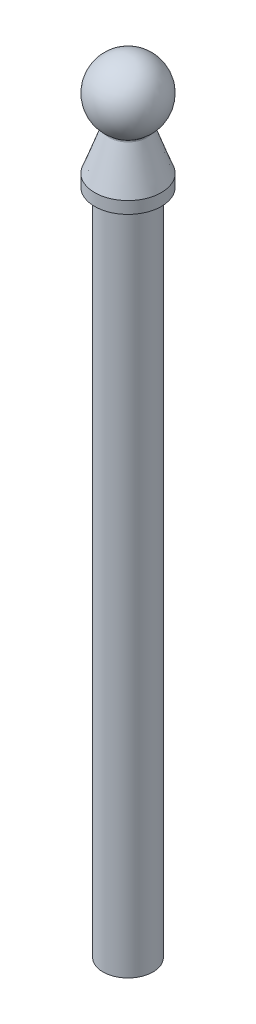
ISO-10303-21;
HEADER;
FILE_DESCRIPTION(('STEP AP214'),'2;1');
FILE_NAME('part.step','',(''),(''),'','','');
FILE_SCHEMA(('AUTOMOTIVE_DESIGN { 1 0 10303 214 1 1 1 1 }'));
ENDSEC;
DATA;
#1=APPLICATION_CONTEXT('core data for automotive mechanical design processes');
#2=APPLICATION_PROTOCOL_DEFINITION('international standard','automotive_design',2000,#1);
#3=PRODUCT_CONTEXT('',#1,'mechanical');
#4=PRODUCT('Part','Part','',(#3));
#5=PRODUCT_RELATED_PRODUCT_CATEGORY('part','',(#4));
#6=PRODUCT_DEFINITION_FORMATION('','',#4);
#7=PRODUCT_DEFINITION_CONTEXT('part definition',#1,'design');
#8=PRODUCT_DEFINITION('design','',#6,#7);
#9=PRODUCT_DEFINITION_SHAPE('','',#8);
#10=(LENGTH_UNIT() NAMED_UNIT(*) SI_UNIT(.MILLI.,.METRE.));
#11=(NAMED_UNIT(*) PLANE_ANGLE_UNIT() SI_UNIT($,.RADIAN.));
#12=(NAMED_UNIT(*) SI_UNIT($,.STERADIAN.) SOLID_ANGLE_UNIT());
#13=UNCERTAINTY_MEASURE_WITH_UNIT(LENGTH_MEASURE(1.E-05),#10,'distance_accuracy_value','');
#14=(GEOMETRIC_REPRESENTATION_CONTEXT(3) GLOBAL_UNCERTAINTY_ASSIGNED_CONTEXT((#13)) GLOBAL_UNIT_ASSIGNED_CONTEXT((#10,
#11,#12)) REPRESENTATION_CONTEXT('',''));
#15=CARTESIAN_POINT('',(0.,0.,0.));
#16=DIRECTION('',(0.,0.,1.));
#17=DIRECTION('',(1.,0.,0.));
#18=AXIS2_PLACEMENT_3D('',#15,#16,#17);
#19=CARTESIAN_POINT('',(-9.63673585374636E-11,97.7333199999983,1.90958360235527E-11));
#20=DIRECTION('',(0.,1.,0.));
#21=DIRECTION('',(0.616561156413366,0.,-0.787307017879437));
#22=AXIS2_PLACEMENT_3D('',#19,#20,#21);
#23=SPHERICAL_SURFACE('',#22,40.);
#24=CARTESIAN_POINT('',(-9.63676972246134E-11,65.1933451381229,1.90960053671276E-11));
#25=DIRECTION('',(0.,1.,0.));
#26=DIRECTION('',(-0.616561156413366,0.,0.787307017879437));
#27=AXIS2_PLACEMENT_3D('',#24,#25,#26);
#28=CIRCLE('',#27,23.2626317511265);
#29=CARTESIAN_POINT('',(-14.3428351337892,65.1933451381229,18.314833232026));
#30=VERTEX_POINT('',#29);
#31=EDGE_CURVE('E56',#30,#30,#28,.T.);
#32=ORIENTED_EDGE('',*,*,#31,.T.);
#33=EDGE_LOOP('',(#32));
#34=FACE_BOUND('',#33,.T.);
#35=ADVANCED_FACE('F37',(#34),#23,.T.);
#36=CARTESIAN_POINT('',(-9.63677060984E-11,64.3407801882264,1.90960098040209E-11));
#37=DIRECTION('',(0.,-1.,0.));
#38=DIRECTION('',(0.616561156413366,0.,-0.787307017879437));
#39=AXIS2_PLACEMENT_3D('',#36,#37,#38);
#40=CONICAL_SURFACE('',#39,22.0213143322379,0.345555580581712);
#41=CARTESIAN_POINT('',(-9.63677212099862E-11,62.8889074584837,1.9096017359814E-11));
#42=DIRECTION('',(0.,-1.,0.));
#43=DIRECTION('',(0.616561156413366,0.,-0.787307017879437));
#44=AXIS2_PLACEMENT_3D('',#41,#42,#43);
#45=CIRCLE('',#44,22.5439885149453);
#46=CARTESIAN_POINT('',(13.899747628848,62.8889074584837,-17.7490403687908));
#47=VERTEX_POINT('',#46);
#48=EDGE_CURVE('E51',#47,#47,#45,.T.);
#49=CARTESIAN_POINT('',(-9.63682258991496E-11,14.3999916607443,1.90962697043957E-11));
#50=DIRECTION('',(0.,1.,0.));
#51=DIRECTION('',(-0.616561156413366,0.,0.787307017879437));
#52=AXIS2_PLACEMENT_3D('',#49,#50,#51);
#53=CIRCLE('',#52,39.9999982021314);
#54=CARTESIAN_POINT('',(24.6624451479424,14.3999916607443,-31.4922792996839));
#55=VERTEX_POINT('',#54);
#56=EDGE_CURVE('E60',#55,#55,#53,.T.);
#57=CARTESIAN_POINT('',(13.899747628848,62.8889074584837,-17.7490403687908));
#58=CARTESIAN_POINT('',(14.0118590613385,62.3838145855906,-17.8921991076542));
#59=CARTESIAN_POINT('',(14.1239704938291,61.8787217126974,-18.0353578465177));
#60=CARTESIAN_POINT('',(14.3481933588102,60.8685359669112,-18.3216753242447));
#61=CARTESIAN_POINT('',(14.4603047913008,60.3634430940181,-18.4648340631081));
#62=CARTESIAN_POINT('',(14.6845276562819,59.3532573482318,-18.7511515408351));
#63=CARTESIAN_POINT('',(14.7966390887725,58.8481644753387,-18.8943102796985));
#64=CARTESIAN_POINT('',(15.0208619537536,57.8379787295525,-19.1806277574255));
#65=CARTESIAN_POINT('',(15.1329733862442,57.3328858566594,-19.3237864962889));
#66=CARTESIAN_POINT('',(15.3571962512253,56.3227001108731,-19.6101039740159));
#67=CARTESIAN_POINT('',(15.4693076837159,55.81760723798,-19.7532627128793));
#68=CARTESIAN_POINT('',(15.693530548697,54.8074214921938,-20.0395801906063));
#69=CARTESIAN_POINT('',(15.8056419811876,54.3023286193007,-20.1827389294698));
#70=CARTESIAN_POINT('',(16.0298648461687,53.2921428735144,-20.4690564071967));
#71=CARTESIAN_POINT('',(16.1419762786593,52.7870500006213,-20.6122151460602));
#72=CARTESIAN_POINT('',(16.3661991436404,51.7768642548351,-20.8985326237871));
#73=CARTESIAN_POINT('',(16.478310576131,51.271771381942,-21.0416913626506));
#74=CARTESIAN_POINT('',(16.7025334411121,50.2615856361557,-21.3280088403775));
#75=CARTESIAN_POINT('',(16.8146448736027,49.7564927632626,-21.471167579241));
#76=CARTESIAN_POINT('',(17.0388677385838,48.7463070174764,-21.7574850569679));
#77=CARTESIAN_POINT('',(17.1509791710744,48.2412141445833,-21.9006437958314));
#78=CARTESIAN_POINT('',(17.3752020360555,47.231028398797,-22.1869612735583));
#79=CARTESIAN_POINT('',(17.4873134685461,46.7259355259039,-22.3301200124218));
#80=CARTESIAN_POINT('',(17.7115363335272,45.7157497801177,-22.6164374901487));
#81=CARTESIAN_POINT('',(17.8236477660178,45.2106569072245,-22.7595962290122));
#82=CARTESIAN_POINT('',(18.0478706309989,44.2004711614383,-23.0459137067391));
#83=CARTESIAN_POINT('',(18.1599820634895,43.6953782885452,-23.1890724456026));
#84=CARTESIAN_POINT('',(18.3842049284706,42.685192542759,-23.4753899233296));
#85=CARTESIAN_POINT('',(18.4963163609612,42.1800996698658,-23.618548662193));
#86=CARTESIAN_POINT('',(18.7205392259423,41.1699139240796,-23.90486613992));
#87=CARTESIAN_POINT('',(18.8326506584329,40.6648210511865,-24.0480248787834));
#88=CARTESIAN_POINT('',(19.056873523414,39.6546353054003,-24.3343423565104));
#89=CARTESIAN_POINT('',(19.1689849559046,39.1495424325071,-24.4775010953738));
#90=CARTESIAN_POINT('',(19.3932078208857,38.1393566867209,-24.7638185731008));
#91=CARTESIAN_POINT('',(19.5053192533763,37.6342638138278,-24.9069773119643));
#92=CARTESIAN_POINT('',(19.7295421183574,36.6240780680415,-25.1932947896912));
#93=CARTESIAN_POINT('',(19.841653550848,36.1189851951484,-25.3364535285547));
#94=CARTESIAN_POINT('',(20.0658764158291,35.1087994493622,-25.6227710062816));
#95=CARTESIAN_POINT('',(20.1779878483197,34.6037065764691,-25.7659297451451));
#96=CARTESIAN_POINT('',(20.4022107133008,33.5935208306828,-26.052247222872));
#97=CARTESIAN_POINT('',(20.5143221457914,33.0884279577897,-26.1954059617355));
#98=CARTESIAN_POINT('',(20.7385450107725,32.0782422120035,-26.4817234394624));
#99=CARTESIAN_POINT('',(20.8506564432631,31.5731493391104,-26.6248821783259));
#100=CARTESIAN_POINT('',(21.0748793082442,30.5629635933241,-26.9111996560528));
#101=CARTESIAN_POINT('',(21.1869907407348,30.057870720431,-27.0543583949163));
#102=CARTESIAN_POINT('',(21.4112136057159,29.0476849746448,-27.3406758726432));
#103=CARTESIAN_POINT('',(21.5233250382065,28.5425921017517,-27.4838346115067));
#104=CARTESIAN_POINT('',(21.7475479031876,27.5324063559654,-27.7701520892336));
#105=CARTESIAN_POINT('',(21.8596593356782,27.0273134830723,-27.9133108280971));
#106=CARTESIAN_POINT('',(22.0838822006593,26.0171277372861,-28.199628305824));
#107=CARTESIAN_POINT('',(22.1959936331499,25.5120348643929,-28.3427870446875));
#108=CARTESIAN_POINT('',(22.420216498131,24.5018491186067,-28.6291045224145));
#109=CARTESIAN_POINT('',(22.5323279306216,23.9967562457136,-28.7722632612779));
#110=CARTESIAN_POINT('',(22.7565507956027,22.9865704999273,-29.0585807390049));
#111=CARTESIAN_POINT('',(22.8686622280933,22.4814776270342,-29.2017394778683));
#112=CARTESIAN_POINT('',(23.0928850930744,21.471291881248,-29.4880569555953));
#113=CARTESIAN_POINT('',(23.204996525565,20.9661990083549,-29.6312156944587));
#114=CARTESIAN_POINT('',(23.4292193905461,19.9560132625686,-29.9175331721857));
#115=CARTESIAN_POINT('',(23.5413308230367,19.4509203896755,-30.0606919110492));
#116=CARTESIAN_POINT('',(23.7655536880178,18.4407346438893,-30.3470093887761));
#117=CARTESIAN_POINT('',(23.8776651205084,17.9356417709962,-30.4901681276396));
#118=CARTESIAN_POINT('',(24.1018879854895,16.9254560252099,-30.7764856053665));
#119=CARTESIAN_POINT('',(24.2139994179801,16.4203631523168,-30.91964434423));
#120=CARTESIAN_POINT('',(24.4382222829612,15.4101774065306,-31.2059618219569));
#121=CARTESIAN_POINT('',(24.5503337154518,14.9050845336375,-31.3491205608204));
#122=CARTESIAN_POINT('',(24.6624451479424,14.3999916607443,-31.4922792996839));
#123=B_SPLINE_CURVE_WITH_KNOTS('',3,(#57,#58,#59,#60,#61,#62,#63,#64,#65,#66,#67,#68,#69,#70,
#71,#72,#73,#74,#75,#76,#77,#78,#79,#80,#81,#82,#83,#84,#85,#86,#87,#88,#89,#90,#91,#92,#93,#94,
#95,#96,#97,#98,#99,#100,#101,#102,#103,#104,#105,#106,#107,#108,#109,#110,#111,#112,#113,#114,
#115,#116,#117,#118,#119,#120,#121,#122),.UNSPECIFIED.,.F.,.F.,(4,2,2,2,2,2,2,2,2,2,2,2,2,2,2,2,
2,2,2,2,2,2,2,2,2,2,2,2,2,2,2,2,4),(0.,1.61047815027071,3.22095630054144,4.83143445081216,
6.44191260108288,8.0523907513536,9.66286890162432,11.273347051895,12.8838252021658,
14.4943033524365,16.1047815027072,17.7152596529779,19.3257378032487,20.9362159535194,
22.5466941037901,24.1571722540608,25.7676504043315,27.3781285546023,28.988606704873,
30.5990848551437,32.2095630054144,33.8200411556852,35.4305193059559,37.0409974562266,
38.6514756064973,40.261953756768,41.8724319070388,43.4829100573095,45.0933882075802,
46.7038663578509,48.3143445081216,49.9248226583924,51.5353008086631),.UNSPECIFIED.);
#124=EDGE_CURVE('BSEAM82',#47,#55,#123,.T.);
#125=ORIENTED_EDGE('',*,*,#48,.T.);
#126=ORIENTED_EDGE('',*,*,#56,.T.);
#127=ORIENTED_EDGE('',*,*,#124,.T.);
#128=ORIENTED_EDGE('',*,*,#124,.F.);
#129=EDGE_LOOP('',(#125,#127,#126,#128));
#130=FACE_BOUND('',#129,.T.);
#131=ADVANCED_FACE('F82',(#130),#40,.T.);
#132=CARTESIAN_POINT('',(-9.63670982996848E-11,122.736130952208,1.90957059046633E-11));
#133=DIRECTION('',(0.,1.,0.));
#134=DIRECTION('',(-0.616561156413366,0.,0.787307017879437));
#135=AXIS2_PLACEMENT_3D('',#132,#133,#134);
#136=CYLINDRICAL_SURFACE('',#135,39.9999982021314);
#137=CARTESIAN_POINT('',(-9.63683757792082E-11,-3.56000165457893E-06,1.9096344644425E-11));
#138=DIRECTION('',(0.,1.,0.));
#139=DIRECTION('',(-0.616561156413366,0.,0.787307017879437));
#140=AXIS2_PLACEMENT_3D('',#137,#138,#139);
#141=CIRCLE('',#140,39.9999982021314);
#142=CARTESIAN_POINT('',(-24.6624451481351,-3.56000165415834E-06,31.492279299722));
#143=VERTEX_POINT('',#142);
#144=EDGE_CURVE('E64',#143,#143,#141,.T.);
#145=ORIENTED_EDGE('',*,*,#144,.T.);
#146=EDGE_LOOP('',(#145));
#147=FACE_BOUND('',#146,.T.);
#148=ORIENTED_EDGE('',*,*,#56,.F.);
#149=EDGE_LOOP('',(#148));
#150=FACE_BOUND('',#149,.T.);
#151=ADVANCED_FACE('F68',(#147,#150),#136,.T.);
#152=CARTESIAN_POINT('',(-6.16561094766889,-3.56000164070114E-06,7.87306939150647));
#153=DIRECTION('',(0.,-1.,0.));
#154=DIRECTION('',(0.616561156413366,0.,-0.787307017879437));
#155=AXIS2_PLACEMENT_3D('',#152,#153,#154);
#156=PLANE('',#155);
#157=CARTESIAN_POINT('',(0.,0.,0.));
#158=DIRECTION('',(0.,1.,0.));
#159=DIRECTION('',(0.,0.,1.));
#160=AXIS2_PLACEMENT_3D('',#157,#158,#159);
#161=CIRCLE('',#160,30.);
#162=CARTESIAN_POINT('',(0.,0.,30.));
#163=VERTEX_POINT('',#162);
#164=EDGE_CURVE('E41',#163,#163,#161,.T.);
#165=ORIENTED_EDGE('',*,*,#164,.T.);
#166=EDGE_LOOP('',(#165));
#167=FACE_BOUND('',#166,.T.);
#168=ORIENTED_EDGE('',*,*,#144,.F.);
#169=EDGE_LOOP('',(#168));
#170=FACE_BOUND('',#169,.T.);
#171=ADVANCED_FACE('F71',(#167,#170),#156,.T.);
#172=CARTESIAN_POINT('',(-9.63677141589709E-11,63.5663463950292,1.90960138343063E-11));
#173=DIRECTION('',(0.,1.,0.));
#174=DIRECTION('',(-0.616561156413366,0.,0.787307017879437));
#175=AXIS2_PLACEMENT_3D('',#172,#173,#174);
#176=TOROIDAL_SURFACE('',#175,24.4257633386828,2.);
#177=ORIENTED_EDGE('',*,*,#48,.F.);
#178=EDGE_LOOP('',(#177));
#179=FACE_BOUND('',#178,.T.);
#180=ORIENTED_EDGE('',*,*,#31,.F.);
#181=EDGE_LOOP('',(#180));
#182=FACE_BOUND('',#181,.T.);
#183=ADVANCED_FACE('F73',(#179,#182),#176,.F.);
#184=CARTESIAN_POINT('',(0.,-800.,0.));
#185=DIRECTION('',(0.,1.,0.));
#186=DIRECTION('',(0.,0.,1.));
#187=AXIS2_PLACEMENT_3D('',#184,#185,#186);
#188=CYLINDRICAL_SURFACE('',#187,30.);
#189=CARTESIAN_POINT('',(0.,-800.,0.));
#190=DIRECTION('',(0.,1.,0.));
#191=DIRECTION('',(0.,0.,1.));
#192=AXIS2_PLACEMENT_3D('',#189,#190,#191);
#193=CIRCLE('',#192,30.);
#194=CARTESIAN_POINT('',(0.,-800.,30.));
#195=VERTEX_POINT('',#194);
#196=EDGE_CURVE('E10',#195,#195,#193,.T.);
#197=ORIENTED_EDGE('',*,*,#196,.T.);
#198=EDGE_LOOP('',(#197));
#199=FACE_BOUND('',#198,.T.);
#200=ORIENTED_EDGE('',*,*,#164,.F.);
#201=EDGE_LOOP('',(#200));
#202=FACE_BOUND('',#201,.T.);
#203=ADVANCED_FACE('F39',(#199,#202),#188,.T.);
#204=CARTESIAN_POINT('',(0.,-800.,0.));
#205=DIRECTION('',(0.,1.,0.));
#206=DIRECTION('',(0.,0.,1.));
#207=AXIS2_PLACEMENT_3D('',#204,#205,#206);
#208=PLANE('',#207);
#209=ORIENTED_EDGE('',*,*,#196,.F.);
#210=EDGE_LOOP('',(#209));
#211=FACE_BOUND('',#210,.T.);
#212=ADVANCED_FACE('F92',(#211),#208,.F.);
#213=CLOSED_SHELL('',(#35,#131,#151,#171,#183,#203,#212));
#214=MANIFOLD_SOLID_BREP('B2',#213);
#215=ADVANCED_BREP_SHAPE_REPRESENTATION('',(#18,#214),#14);
#216=SHAPE_DEFINITION_REPRESENTATION(#9,#215);
ENDSEC;
END-ISO-10303-21;
